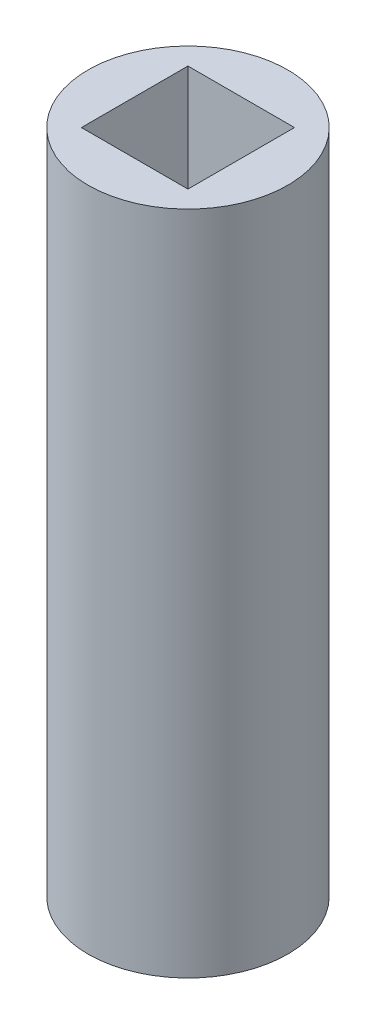
ISO-10303-21;
HEADER;
FILE_DESCRIPTION(('STEP AP214'),'2;1');
FILE_NAME('part.step','',(''),(''),'','','');
FILE_SCHEMA(('AUTOMOTIVE_DESIGN { 1 0 10303 214 1 1 1 1 }'));
ENDSEC;
DATA;
#1=APPLICATION_CONTEXT('core data for automotive mechanical design processes');
#2=APPLICATION_PROTOCOL_DEFINITION('international standard','automotive_design',2000,#1);
#3=PRODUCT_CONTEXT('',#1,'mechanical');
#4=PRODUCT('Part','Part','',(#3));
#5=PRODUCT_RELATED_PRODUCT_CATEGORY('part','',(#4));
#6=PRODUCT_DEFINITION_FORMATION('','',#4);
#7=PRODUCT_DEFINITION_CONTEXT('part definition',#1,'design');
#8=PRODUCT_DEFINITION('design','',#6,#7);
#9=PRODUCT_DEFINITION_SHAPE('','',#8);
#10=(LENGTH_UNIT() NAMED_UNIT(*) SI_UNIT(.MILLI.,.METRE.));
#11=(NAMED_UNIT(*) PLANE_ANGLE_UNIT() SI_UNIT($,.RADIAN.));
#12=(NAMED_UNIT(*) SI_UNIT($,.STERADIAN.) SOLID_ANGLE_UNIT());
#13=UNCERTAINTY_MEASURE_WITH_UNIT(LENGTH_MEASURE(1.E-05),#10,'distance_accuracy_value','');
#14=(GEOMETRIC_REPRESENTATION_CONTEXT(3) GLOBAL_UNCERTAINTY_ASSIGNED_CONTEXT((#13)) GLOBAL_UNIT_ASSIGNED_CONTEXT((#10,
#11,#12)) REPRESENTATION_CONTEXT('',''));
#15=CARTESIAN_POINT('',(0.,0.,0.));
#16=DIRECTION('',(0.,0.,1.));
#17=DIRECTION('',(1.,0.,0.));
#18=AXIS2_PLACEMENT_3D('',#15,#16,#17);
#19=CARTESIAN_POINT('',(0.,20.,0.));
#20=DIRECTION('',(0.,1.,0.));
#21=DIRECTION('',(0.,0.,1.));
#22=AXIS2_PLACEMENT_3D('',#19,#20,#21);
#23=PLANE('',#22);
#24=CARTESIAN_POINT('',(0.,20.,0.));
#25=DIRECTION('',(0.,1.,0.));
#26=DIRECTION('',(0.,0.,1.));
#27=AXIS2_PLACEMENT_3D('',#24,#25,#26);
#28=CIRCLE('',#27,3.);
#29=CARTESIAN_POINT('',(0.,20.,3.));
#30=VERTEX_POINT('',#29);
#31=EDGE_CURVE('E11',#30,#30,#28,.T.);
#32=ORIENTED_EDGE('',*,*,#31,.T.);
#33=EDGE_LOOP('',(#32));
#34=FACE_BOUND('',#33,.T.);
#35=DIRECTION('',(-1.,0.,0.));
#36=VECTOR('',#35,1.);
#37=CARTESIAN_POINT('',(-1.6,20.,-1.6));
#38=LINE('',#37,#36);
#39=CARTESIAN_POINT('',(1.6,20.,-1.6));
#40=VERTEX_POINT('',#39);
#41=CARTESIAN_POINT('',(-1.6,20.,-1.6));
#42=VERTEX_POINT('',#41);
#43=EDGE_CURVE('E86',#40,#42,#38,.T.);
#44=ORIENTED_EDGE('',*,*,#43,.F.);
#45=DIRECTION('',(0.,0.,-1.));
#46=VECTOR('',#45,1.);
#47=CARTESIAN_POINT('',(1.6,20.,1.6));
#48=LINE('',#47,#46);
#49=CARTESIAN_POINT('',(1.6,20.,1.6));
#50=VERTEX_POINT('',#49);
#51=EDGE_CURVE('E78',#50,#40,#48,.T.);
#52=ORIENTED_EDGE('',*,*,#51,.F.);
#53=DIRECTION('',(1.,0.,0.));
#54=VECTOR('',#53,1.);
#55=CARTESIAN_POINT('',(-1.6,20.,1.6));
#56=LINE('',#55,#54);
#57=CARTESIAN_POINT('',(-1.6,20.,1.6));
#58=VERTEX_POINT('',#57);
#59=EDGE_CURVE('E99',#58,#50,#56,.T.);
#60=ORIENTED_EDGE('',*,*,#59,.F.);
#61=DIRECTION('',(0.,0.,1.));
#62=VECTOR('',#61,1.);
#63=CARTESIAN_POINT('',(-1.6,20.,1.6));
#64=LINE('',#63,#62);
#65=EDGE_CURVE('E97',#42,#58,#64,.T.);
#66=ORIENTED_EDGE('',*,*,#65,.F.);
#67=EDGE_LOOP('',(#44,#52,#60,#66));
#68=FACE_BOUND('',#67,.T.);
#69=ADVANCED_FACE('F37',(#34,#68),#23,.T.);
#70=CARTESIAN_POINT('',(0.,0.,0.));
#71=DIRECTION('',(0.,1.,0.));
#72=DIRECTION('',(0.,0.,1.));
#73=AXIS2_PLACEMENT_3D('',#70,#71,#72);
#74=PLANE('',#73);
#75=CARTESIAN_POINT('',(0.,0.,0.));
#76=DIRECTION('',(0.,1.,0.));
#77=DIRECTION('',(0.,0.,1.));
#78=AXIS2_PLACEMENT_3D('',#75,#76,#77);
#79=CIRCLE('',#78,3.);
#80=CARTESIAN_POINT('',(0.,0.,3.));
#81=VERTEX_POINT('',#80);
#82=EDGE_CURVE('E41',#81,#81,#79,.T.);
#83=ORIENTED_EDGE('',*,*,#82,.F.);
#84=EDGE_LOOP('',(#83));
#85=FACE_BOUND('',#84,.T.);
#86=DIRECTION('',(0.,0.,-1.));
#87=VECTOR('',#86,1.);
#88=CARTESIAN_POINT('',(1.6,0.,1.6));
#89=LINE('',#88,#87);
#90=CARTESIAN_POINT('',(1.6,0.,1.6));
#91=VERTEX_POINT('',#90);
#92=CARTESIAN_POINT('',(1.6,0.,-1.6));
#93=VERTEX_POINT('',#92);
#94=EDGE_CURVE('E60',#91,#93,#89,.T.);
#95=ORIENTED_EDGE('',*,*,#94,.T.);
#96=DIRECTION('',(-1.,0.,0.));
#97=VECTOR('',#96,1.);
#98=CARTESIAN_POINT('',(-1.6,0.,-1.6));
#99=LINE('',#98,#97);
#100=CARTESIAN_POINT('',(-1.6,0.,-1.6));
#101=VERTEX_POINT('',#100);
#102=EDGE_CURVE('E93',#93,#101,#99,.T.);
#103=ORIENTED_EDGE('',*,*,#102,.T.);
#104=DIRECTION('',(0.,0.,1.));
#105=VECTOR('',#104,1.);
#106=CARTESIAN_POINT('',(-1.6,0.,1.6));
#107=LINE('',#106,#105);
#108=CARTESIAN_POINT('',(-1.6,0.,1.6));
#109=VERTEX_POINT('',#108);
#110=EDGE_CURVE('E105',#101,#109,#107,.T.);
#111=ORIENTED_EDGE('',*,*,#110,.T.);
#112=DIRECTION('',(1.,0.,0.));
#113=VECTOR('',#112,1.);
#114=CARTESIAN_POINT('',(-1.6,0.,1.6));
#115=LINE('',#114,#113);
#116=EDGE_CURVE('E87',#109,#91,#115,.T.);
#117=ORIENTED_EDGE('',*,*,#116,.T.);
#118=EDGE_LOOP('',(#95,#103,#111,#117));
#119=FACE_BOUND('',#118,.T.);
#120=ADVANCED_FACE('F116',(#85,#119),#74,.F.);
#121=CARTESIAN_POINT('',(0.,20.,0.));
#122=DIRECTION('',(0.,-1.,0.));
#123=DIRECTION('',(0.,0.,-1.));
#124=AXIS2_PLACEMENT_3D('',#121,#122,#123);
#125=CYLINDRICAL_SURFACE('',#124,3.);
#126=ORIENTED_EDGE('',*,*,#31,.F.);
#127=EDGE_LOOP('',(#126));
#128=FACE_BOUND('',#127,.T.);
#129=ORIENTED_EDGE('',*,*,#82,.T.);
#130=EDGE_LOOP('',(#129));
#131=FACE_BOUND('',#130,.T.);
#132=ADVANCED_FACE('F39',(#128,#131),#125,.T.);
#133=CARTESIAN_POINT('',(1.6,20.,1.6));
#134=DIRECTION('',(-1.,0.,0.));
#135=DIRECTION('',(0.,0.,1.));
#136=AXIS2_PLACEMENT_3D('',#133,#134,#135);
#137=PLANE('',#136);
#138=ORIENTED_EDGE('',*,*,#94,.F.);
#139=DIRECTION('',(0.,-1.,0.));
#140=VECTOR('',#139,1.);
#141=CARTESIAN_POINT('',(1.6,20.,1.6));
#142=LINE('',#141,#140);
#143=EDGE_CURVE('E82',#50,#91,#142,.T.);
#144=ORIENTED_EDGE('',*,*,#143,.F.);
#145=ORIENTED_EDGE('',*,*,#51,.T.);
#146=DIRECTION('',(0.,-1.,0.));
#147=VECTOR('',#146,1.);
#148=CARTESIAN_POINT('',(1.6,20.,-1.6));
#149=LINE('',#148,#147);
#150=EDGE_CURVE('E81',#40,#93,#149,.T.);
#151=ORIENTED_EDGE('',*,*,#150,.T.);
#152=EDGE_LOOP('',(#138,#144,#145,#151));
#153=FACE_BOUND('',#152,.T.);
#154=ADVANCED_FACE('F80',(#153),#137,.T.);
#155=CARTESIAN_POINT('',(-1.6,20.,-1.6));
#156=DIRECTION('',(0.,0.,1.));
#157=DIRECTION('',(1.,0.,0.));
#158=AXIS2_PLACEMENT_3D('',#155,#156,#157);
#159=PLANE('',#158);
#160=ORIENTED_EDGE('',*,*,#102,.F.);
#161=ORIENTED_EDGE('',*,*,#150,.F.);
#162=ORIENTED_EDGE('',*,*,#43,.T.);
#163=DIRECTION('',(0.,-1.,0.));
#164=VECTOR('',#163,1.);
#165=CARTESIAN_POINT('',(-1.6,20.,-1.6));
#166=LINE('',#165,#164);
#167=EDGE_CURVE('E94',#42,#101,#166,.T.);
#168=ORIENTED_EDGE('',*,*,#167,.T.);
#169=EDGE_LOOP('',(#160,#161,#162,#168));
#170=FACE_BOUND('',#169,.T.);
#171=ADVANCED_FACE('F90',(#170),#159,.T.);
#172=CARTESIAN_POINT('',(-1.6,20.,1.6));
#173=DIRECTION('',(1.,0.,0.));
#174=DIRECTION('',(0.,0.,-1.));
#175=AXIS2_PLACEMENT_3D('',#172,#173,#174);
#176=PLANE('',#175);
#177=ORIENTED_EDGE('',*,*,#110,.F.);
#178=ORIENTED_EDGE('',*,*,#167,.F.);
#179=ORIENTED_EDGE('',*,*,#65,.T.);
#180=DIRECTION('',(0.,-1.,0.));
#181=VECTOR('',#180,1.);
#182=CARTESIAN_POINT('',(-1.6,20.,1.6));
#183=LINE('',#182,#181);
#184=EDGE_CURVE('E52',#58,#109,#183,.T.);
#185=ORIENTED_EDGE('',*,*,#184,.T.);
#186=EDGE_LOOP('',(#177,#178,#179,#185));
#187=FACE_BOUND('',#186,.T.);
#188=ADVANCED_FACE('F114',(#187),#176,.T.);
#189=CARTESIAN_POINT('',(-1.6,20.,1.6));
#190=DIRECTION('',(0.,0.,-1.));
#191=DIRECTION('',(-1.,0.,0.));
#192=AXIS2_PLACEMENT_3D('',#189,#190,#191);
#193=PLANE('',#192);
#194=ORIENTED_EDGE('',*,*,#116,.F.);
#195=ORIENTED_EDGE('',*,*,#184,.F.);
#196=ORIENTED_EDGE('',*,*,#59,.T.);
#197=ORIENTED_EDGE('',*,*,#143,.T.);
#198=EDGE_LOOP('',(#194,#195,#196,#197));
#199=FACE_BOUND('',#198,.T.);
#200=ADVANCED_FACE('F117',(#199),#193,.T.);
#201=CLOSED_SHELL('',(#69,#120,#132,#154,#171,#188,#200));
#202=MANIFOLD_SOLID_BREP('B2',#201);
#203=ADVANCED_BREP_SHAPE_REPRESENTATION('',(#18,#202),#14);
#204=SHAPE_DEFINITION_REPRESENTATION(#9,#203);
ENDSEC;
END-ISO-10303-21;
